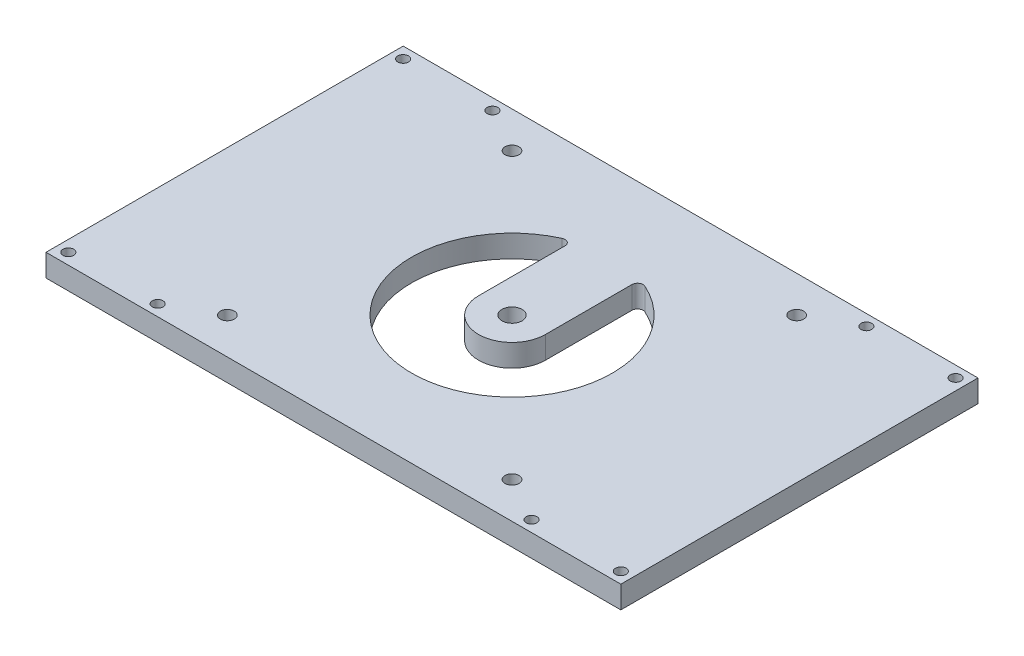
ISO-10303-21;
HEADER;
FILE_DESCRIPTION(('STEP AP214'),'2;1');
FILE_NAME('part.step','',(''),(''),'','','');
FILE_SCHEMA(('AUTOMOTIVE_DESIGN { 1 0 10303 214 1 1 1 1 }'));
ENDSEC;
DATA;
#1=APPLICATION_CONTEXT('core data for automotive mechanical design processes');
#2=APPLICATION_PROTOCOL_DEFINITION('international standard','automotive_design',2000,#1);
#3=PRODUCT_CONTEXT('',#1,'mechanical');
#4=PRODUCT('Part','Part','',(#3));
#5=PRODUCT_RELATED_PRODUCT_CATEGORY('part','',(#4));
#6=PRODUCT_DEFINITION_FORMATION('','',#4);
#7=PRODUCT_DEFINITION_CONTEXT('part definition',#1,'design');
#8=PRODUCT_DEFINITION('design','',#6,#7);
#9=PRODUCT_DEFINITION_SHAPE('','',#8);
#10=(LENGTH_UNIT() NAMED_UNIT(*) SI_UNIT(.MILLI.,.METRE.));
#11=(NAMED_UNIT(*) PLANE_ANGLE_UNIT() SI_UNIT($,.RADIAN.));
#12=(NAMED_UNIT(*) SI_UNIT($,.STERADIAN.) SOLID_ANGLE_UNIT());
#13=UNCERTAINTY_MEASURE_WITH_UNIT(LENGTH_MEASURE(1.E-05),#10,'distance_accuracy_value','');
#14=(GEOMETRIC_REPRESENTATION_CONTEXT(3) GLOBAL_UNCERTAINTY_ASSIGNED_CONTEXT((#13)) GLOBAL_UNIT_ASSIGNED_CONTEXT((#10,
#11,#12)) REPRESENTATION_CONTEXT('',''));
#15=CARTESIAN_POINT('',(0.,0.,0.));
#16=DIRECTION('',(0.,0.,1.));
#17=DIRECTION('',(1.,0.,0.));
#18=AXIS2_PLACEMENT_3D('',#15,#16,#17);
#19=CARTESIAN_POINT('',(-33.6068002357864,6.35,-20.9249888260557));
#20=DIRECTION('',(1.,0.,0.));
#21=DIRECTION('',(0.,0.,-1.));
#22=AXIS2_PLACEMENT_3D('',#19,#20,#21);
#23=PLANE('',#22);
#24=DIRECTION('',(0.,0.,1.));
#25=VECTOR('',#24,1.);
#26=CARTESIAN_POINT('',(-33.6068002357864,0.,-20.9249888260557));
#27=LINE('',#26,#25);
#28=CARTESIAN_POINT('',(-33.6068002357864,0.,-20.9249888260557));
#29=VERTEX_POINT('',#28);
#30=CARTESIAN_POINT('',(-33.6068002357864,0.,80.6750111739443));
#31=VERTEX_POINT('',#30);
#32=EDGE_CURVE('E234',#29,#31,#27,.T.);
#33=ORIENTED_EDGE('',*,*,#32,.T.);
#34=DIRECTION('',(0.,-1.,0.));
#35=VECTOR('',#34,1.);
#36=CARTESIAN_POINT('',(-33.6068002357864,6.35,80.6750111739443));
#37=LINE('',#36,#35);
#38=CARTESIAN_POINT('',(-33.6068002357864,6.35,80.6750111739443));
#39=VERTEX_POINT('',#38);
#40=EDGE_CURVE('E11',#39,#31,#37,.T.);
#41=ORIENTED_EDGE('',*,*,#40,.F.);
#42=DIRECTION('',(0.,0.,1.));
#43=VECTOR('',#42,1.);
#44=CARTESIAN_POINT('',(-33.6068002357864,6.35,-20.9249888260557));
#45=LINE('',#44,#43);
#46=CARTESIAN_POINT('',(-33.6068002357864,6.35,-20.9249888260557));
#47=VERTEX_POINT('',#46);
#48=EDGE_CURVE('E237',#47,#39,#45,.T.);
#49=ORIENTED_EDGE('',*,*,#48,.F.);
#50=DIRECTION('',(0.,-1.,0.));
#51=VECTOR('',#50,1.);
#52=CARTESIAN_POINT('',(-33.6068002357864,6.35,-20.9249888260557));
#53=LINE('',#52,#51);
#54=EDGE_CURVE('E247',#47,#29,#53,.T.);
#55=ORIENTED_EDGE('',*,*,#54,.T.);
#56=EDGE_LOOP('',(#33,#41,#49,#55));
#57=FACE_BOUND('',#56,.T.);
#58=ADVANCED_FACE('F31',(#57),#23,.F.);
#59=CARTESIAN_POINT('',(-33.6068002357864,6.35,80.6750111739443));
#60=DIRECTION('',(0.,0.,-1.));
#61=DIRECTION('',(-1.,0.,0.));
#62=AXIS2_PLACEMENT_3D('',#59,#60,#61);
#63=PLANE('',#62);
#64=DIRECTION('',(1.,0.,0.));
#65=VECTOR('',#64,1.);
#66=CARTESIAN_POINT('',(-33.6068002357864,0.,80.6750111739443));
#67=LINE('',#66,#65);
#68=CARTESIAN_POINT('',(129.905699764214,0.,80.6750111739443));
#69=VERTEX_POINT('',#68);
#70=EDGE_CURVE('E250',#31,#69,#67,.T.);
#71=ORIENTED_EDGE('',*,*,#70,.T.);
#72=DIRECTION('',(0.,-1.,0.));
#73=VECTOR('',#72,1.);
#74=CARTESIAN_POINT('',(129.905699764214,6.35,80.6750111739443));
#75=LINE('',#74,#73);
#76=CARTESIAN_POINT('',(129.905699764214,6.35,80.6750111739443));
#77=VERTEX_POINT('',#76);
#78=EDGE_CURVE('E38',#77,#69,#75,.T.);
#79=ORIENTED_EDGE('',*,*,#78,.F.);
#80=DIRECTION('',(1.,0.,0.));
#81=VECTOR('',#80,1.);
#82=CARTESIAN_POINT('',(-33.6068002357864,6.35,80.6750111739443));
#83=LINE('',#82,#81);
#84=EDGE_CURVE('E240',#39,#77,#83,.T.);
#85=ORIENTED_EDGE('',*,*,#84,.F.);
#86=ORIENTED_EDGE('',*,*,#40,.T.);
#87=EDGE_LOOP('',(#71,#79,#85,#86));
#88=FACE_BOUND('',#87,.T.);
#89=ADVANCED_FACE('F279',(#88),#63,.F.);
#90=CARTESIAN_POINT('',(129.905699764214,6.35,-20.9249888260557));
#91=DIRECTION('',(-1.,0.,0.));
#92=DIRECTION('',(0.,0.,1.));
#93=AXIS2_PLACEMENT_3D('',#90,#91,#92);
#94=PLANE('',#93);
#95=DIRECTION('',(0.,0.,-1.));
#96=VECTOR('',#95,1.);
#97=CARTESIAN_POINT('',(129.905699764214,0.,-20.9249888260557));
#98=LINE('',#97,#96);
#99=CARTESIAN_POINT('',(129.905699764214,0.,-20.9249888260557));
#100=VERTEX_POINT('',#99);
#101=EDGE_CURVE('E252',#69,#100,#98,.T.);
#102=ORIENTED_EDGE('',*,*,#101,.T.);
#103=DIRECTION('',(0.,-1.,0.));
#104=VECTOR('',#103,1.);
#105=CARTESIAN_POINT('',(129.905699764214,6.35,-20.9249888260557));
#106=LINE('',#105,#104);
#107=CARTESIAN_POINT('',(129.905699764214,6.35,-20.9249888260557));
#108=VERTEX_POINT('',#107);
#109=EDGE_CURVE('E257',#108,#100,#106,.T.);
#110=ORIENTED_EDGE('',*,*,#109,.F.);
#111=DIRECTION('',(0.,0.,-1.));
#112=VECTOR('',#111,1.);
#113=CARTESIAN_POINT('',(129.905699764214,6.35,-20.9249888260557));
#114=LINE('',#113,#112);
#115=EDGE_CURVE('E243',#77,#108,#114,.T.);
#116=ORIENTED_EDGE('',*,*,#115,.F.);
#117=ORIENTED_EDGE('',*,*,#78,.T.);
#118=EDGE_LOOP('',(#102,#110,#116,#117));
#119=FACE_BOUND('',#118,.T.);
#120=ADVANCED_FACE('F264',(#119),#94,.F.);
#121=CARTESIAN_POINT('',(-33.6068002357864,6.35,-20.9249888260557));
#122=DIRECTION('',(0.,0.,1.));
#123=DIRECTION('',(1.,0.,0.));
#124=AXIS2_PLACEMENT_3D('',#121,#122,#123);
#125=PLANE('',#124);
#126=DIRECTION('',(-1.,0.,0.));
#127=VECTOR('',#126,1.);
#128=CARTESIAN_POINT('',(-33.6068002357864,0.,-20.9249888260557));
#129=LINE('',#128,#127);
#130=EDGE_CURVE('E241',#100,#29,#129,.T.);
#131=ORIENTED_EDGE('',*,*,#130,.T.);
#132=ORIENTED_EDGE('',*,*,#54,.F.);
#133=DIRECTION('',(-1.,0.,0.));
#134=VECTOR('',#133,1.);
#135=CARTESIAN_POINT('',(-33.6068002357864,6.35,-20.9249888260557));
#136=LINE('',#135,#134);
#137=EDGE_CURVE('E245',#108,#47,#136,.T.);
#138=ORIENTED_EDGE('',*,*,#137,.F.);
#139=ORIENTED_EDGE('',*,*,#109,.T.);
#140=EDGE_LOOP('',(#131,#132,#138,#139));
#141=FACE_BOUND('',#140,.T.);
#142=ADVANCED_FACE('F273',(#141),#125,.F.);
#143=CARTESIAN_POINT('',(-33.6068002357864,6.35,-20.9249888260557));
#144=DIRECTION('',(0.,1.,0.));
#145=DIRECTION('',(0.,0.,1.));
#146=AXIS2_PLACEMENT_3D('',#143,#144,#145);
#147=PLANE('',#146);
#148=DIRECTION('',(0.,0.,-1.));
#149=VECTOR('',#148,1.);
#150=CARTESIAN_POINT('',(57.6744497642136,6.35,-120.001620076397));
#151=LINE('',#150,#149);
#152=CARTESIAN_POINT('',(57.6744497642136,6.35,29.8750111739443));
#153=VERTEX_POINT('',#152);
#154=CARTESIAN_POINT('',(57.6744497642136,6.35,5.28156692552723));
#155=VERTEX_POINT('',#154);
#156=EDGE_CURVE('E109',#153,#155,#151,.T.);
#157=ORIENTED_EDGE('',*,*,#156,.T.);
#158=CARTESIAN_POINT('',(59.2619497642136,6.35,5.28156692552721));
#159=DIRECTION('',(0.,-1.,0.));
#160=DIRECTION('',(0.,0.,-1.));
#161=AXIS2_PLACEMENT_3D('',#158,#159,#160);
#162=CIRCLE('',#161,1.5875);
#163=CARTESIAN_POINT('',(59.9156262348018,6.35,3.83489373444386));
#164=VERTEX_POINT('',#163);
#165=EDGE_CURVE('E118',#155,#164,#162,.T.);
#166=ORIENTED_EDGE('',*,*,#165,.T.);
#167=CARTESIAN_POINT('',(48.1494497642136,6.35,29.8750111739443));
#168=DIRECTION('',(0.,-1.,0.));
#169=DIRECTION('',(0.,0.,-1.));
#170=AXIS2_PLACEMENT_3D('',#167,#168,#169);
#171=CIRCLE('',#170,28.575);
#172=CARTESIAN_POINT('',(36.3832732936254,6.35,3.83489373444384));
#173=VERTEX_POINT('',#172);
#174=EDGE_CURVE('E45',#164,#173,#171,.T.);
#175=ORIENTED_EDGE('',*,*,#174,.T.);
#176=CARTESIAN_POINT('',(37.0369497642136,6.35,5.28156692552721));
#177=DIRECTION('',(0.,-1.,0.));
#178=DIRECTION('',(0.,0.,-1.));
#179=AXIS2_PLACEMENT_3D('',#176,#177,#178);
#180=CIRCLE('',#179,1.5875);
#181=CARTESIAN_POINT('',(38.6244497642136,6.35,5.2815669255272));
#182=VERTEX_POINT('',#181);
#183=EDGE_CURVE('E132',#173,#182,#180,.T.);
#184=ORIENTED_EDGE('',*,*,#183,.T.);
#185=DIRECTION('',(0.,0.,-1.));
#186=VECTOR('',#185,1.);
#187=CARTESIAN_POINT('',(38.6244497642136,6.35,-120.001620076397));
#188=LINE('',#187,#186);
#189=CARTESIAN_POINT('',(38.6244497642136,6.35,29.8750111739443));
#190=VERTEX_POINT('',#189);
#191=EDGE_CURVE('E135',#190,#182,#188,.T.);
#192=ORIENTED_EDGE('',*,*,#191,.F.);
#193=CARTESIAN_POINT('',(48.1494497642136,6.35,29.8750111739443));
#194=DIRECTION('',(0.,-1.,0.));
#195=DIRECTION('',(0.,0.,-1.));
#196=AXIS2_PLACEMENT_3D('',#193,#194,#195);
#197=CIRCLE('',#196,9.525);
#198=EDGE_CURVE('E115',#153,#190,#197,.T.);
#199=ORIENTED_EDGE('',*,*,#198,.F.);
#200=EDGE_LOOP('',(#157,#166,#175,#184,#192,#199));
#201=FACE_BOUND('',#200,.T.);
#202=CARTESIAN_POINT('',(48.1494497642136,6.35,29.8750111739443));
#203=DIRECTION('',(0.,1.,0.));
#204=DIRECTION('',(0.,0.,1.));
#205=AXIS2_PLACEMENT_3D('',#202,#203,#204);
#206=CIRCLE('',#205,2.850007);
#207=CARTESIAN_POINT('',(48.1494497642136,6.35,32.7250181739443));
#208=VERTEX_POINT('',#207);
#209=EDGE_CURVE('E151',#208,#208,#206,.T.);
#210=ORIENTED_EDGE('',*,*,#209,.F.);
#211=EDGE_LOOP('',(#210));
#212=FACE_BOUND('',#211,.T.);
#213=CARTESIAN_POINT('',(7.66184976421357,6.35,70.3626111739443));
#214=DIRECTION('',(0.,1.,0.));
#215=DIRECTION('',(0.,0.,1.));
#216=AXIS2_PLACEMENT_3D('',#213,#214,#215);
#217=CIRCLE('',#216,1.984375);
#218=CARTESIAN_POINT('',(7.66184976421357,6.35,72.3469861739443));
#219=VERTEX_POINT('',#218);
#220=EDGE_CURVE('E162',#219,#219,#217,.T.);
#221=ORIENTED_EDGE('',*,*,#220,.F.);
#222=EDGE_LOOP('',(#221));
#223=FACE_BOUND('',#222,.T.);
#224=CARTESIAN_POINT('',(88.6370497642136,6.35,70.3626111739443));
#225=DIRECTION('',(0.,1.,0.));
#226=DIRECTION('',(0.,0.,1.));
#227=AXIS2_PLACEMENT_3D('',#224,#225,#226);
#228=CIRCLE('',#227,1.98437499999999);
#229=CARTESIAN_POINT('',(88.6370497642136,6.35,72.3469861739443));
#230=VERTEX_POINT('',#229);
#231=EDGE_CURVE('E168',#230,#230,#228,.T.);
#232=ORIENTED_EDGE('',*,*,#231,.F.);
#233=EDGE_LOOP('',(#232));
#234=FACE_BOUND('',#233,.T.);
#235=CARTESIAN_POINT('',(88.6370497642136,6.35,-10.6125888260557));
#236=DIRECTION('',(0.,1.,0.));
#237=DIRECTION('',(0.,0.,1.));
#238=AXIS2_PLACEMENT_3D('',#235,#236,#237);
#239=CIRCLE('',#238,1.984375);
#240=CARTESIAN_POINT('',(88.6370497642136,6.35,-8.62821382605569));
#241=VERTEX_POINT('',#240);
#242=EDGE_CURVE('E174',#241,#241,#239,.T.);
#243=ORIENTED_EDGE('',*,*,#242,.F.);
#244=EDGE_LOOP('',(#243));
#245=FACE_BOUND('',#244,.T.);
#246=CARTESIAN_POINT('',(7.66184976421357,6.35,-10.6125888260557));
#247=DIRECTION('',(0.,1.,0.));
#248=DIRECTION('',(0.,0.,1.));
#249=AXIS2_PLACEMENT_3D('',#246,#247,#248);
#250=CIRCLE('',#249,1.984375);
#251=CARTESIAN_POINT('',(7.66184976421357,6.35,-8.62821382605569));
#252=VERTEX_POINT('',#251);
#253=EDGE_CURVE('E180',#252,#252,#250,.T.);
#254=ORIENTED_EDGE('',*,*,#253,.F.);
#255=EDGE_LOOP('',(#254));
#256=FACE_BOUND('',#255,.T.);
#257=CARTESIAN_POINT('',(101.330699764214,6.35,77.5000111739443));
#258=DIRECTION('',(0.,1.,0.));
#259=DIRECTION('',(0.,0.,1.));
#260=AXIS2_PLACEMENT_3D('',#257,#258,#259);
#261=CIRCLE('',#260,1.52399999999999);
#262=CARTESIAN_POINT('',(101.330699764214,6.35,79.0240111739443));
#263=VERTEX_POINT('',#262);
#264=EDGE_CURVE('E186',#263,#263,#261,.T.);
#265=ORIENTED_EDGE('',*,*,#264,.F.);
#266=EDGE_LOOP('',(#265));
#267=FACE_BOUND('',#266,.T.);
#268=CARTESIAN_POINT('',(101.330699764214,6.35,-17.7499888260557));
#269=DIRECTION('',(0.,1.,0.));
#270=DIRECTION('',(0.,0.,1.));
#271=AXIS2_PLACEMENT_3D('',#268,#269,#270);
#272=CIRCLE('',#271,1.52399999999999);
#273=CARTESIAN_POINT('',(101.330699764214,6.35,-16.2259888260557));
#274=VERTEX_POINT('',#273);
#275=EDGE_CURVE('E192',#274,#274,#272,.T.);
#276=ORIENTED_EDGE('',*,*,#275,.F.);
#277=EDGE_LOOP('',(#276));
#278=FACE_BOUND('',#277,.T.);
#279=CARTESIAN_POINT('',(-5.03180023578643,6.35,77.5000111739443));
#280=DIRECTION('',(0.,1.,0.));
#281=DIRECTION('',(0.,0.,1.));
#282=AXIS2_PLACEMENT_3D('',#279,#280,#281);
#283=CIRCLE('',#282,1.524);
#284=CARTESIAN_POINT('',(-5.03180023578643,6.35,79.0240111739443));
#285=VERTEX_POINT('',#284);
#286=EDGE_CURVE('E198',#285,#285,#283,.T.);
#287=ORIENTED_EDGE('',*,*,#286,.F.);
#288=EDGE_LOOP('',(#287));
#289=FACE_BOUND('',#288,.T.);
#290=CARTESIAN_POINT('',(-5.03180023578643,6.35,-17.7499888260557));
#291=DIRECTION('',(0.,1.,0.));
#292=DIRECTION('',(0.,0.,1.));
#293=AXIS2_PLACEMENT_3D('',#290,#291,#292);
#294=CIRCLE('',#293,1.524);
#295=CARTESIAN_POINT('',(-5.03180023578643,6.35,-16.2259888260557));
#296=VERTEX_POINT('',#295);
#297=EDGE_CURVE('E204',#296,#296,#294,.T.);
#298=ORIENTED_EDGE('',*,*,#297,.F.);
#299=EDGE_LOOP('',(#298));
#300=FACE_BOUND('',#299,.T.);
#301=CARTESIAN_POINT('',(126.730699764214,6.35,-17.7499888260557));
#302=DIRECTION('',(0.,1.,0.));
#303=DIRECTION('',(0.,0.,1.));
#304=AXIS2_PLACEMENT_3D('',#301,#302,#303);
#305=CIRCLE('',#304,1.52400000000001);
#306=CARTESIAN_POINT('',(126.730699764214,6.35,-16.2259888260557));
#307=VERTEX_POINT('',#306);
#308=EDGE_CURVE('E210',#307,#307,#305,.T.);
#309=ORIENTED_EDGE('',*,*,#308,.F.);
#310=EDGE_LOOP('',(#309));
#311=FACE_BOUND('',#310,.T.);
#312=CARTESIAN_POINT('',(126.730699764214,6.35,77.5000111739443));
#313=DIRECTION('',(0.,1.,0.));
#314=DIRECTION('',(0.,0.,1.));
#315=AXIS2_PLACEMENT_3D('',#312,#313,#314);
#316=CIRCLE('',#315,1.52400000000001);
#317=CARTESIAN_POINT('',(126.730699764214,6.35,79.0240111739443));
#318=VERTEX_POINT('',#317);
#319=EDGE_CURVE('E216',#318,#318,#316,.T.);
#320=ORIENTED_EDGE('',*,*,#319,.F.);
#321=EDGE_LOOP('',(#320));
#322=FACE_BOUND('',#321,.T.);
#323=CARTESIAN_POINT('',(-30.4318002357864,6.35,77.5000111739443));
#324=DIRECTION('',(0.,1.,0.));
#325=DIRECTION('',(0.,0.,1.));
#326=AXIS2_PLACEMENT_3D('',#323,#324,#325);
#327=CIRCLE('',#326,1.524);
#328=CARTESIAN_POINT('',(-30.4318002357864,6.35,79.0240111739443));
#329=VERTEX_POINT('',#328);
#330=EDGE_CURVE('E222',#329,#329,#327,.T.);
#331=ORIENTED_EDGE('',*,*,#330,.F.);
#332=EDGE_LOOP('',(#331));
#333=FACE_BOUND('',#332,.T.);
#334=CARTESIAN_POINT('',(-30.4318002357864,6.35,-17.7499888260557));
#335=DIRECTION('',(0.,1.,0.));
#336=DIRECTION('',(0.,0.,1.));
#337=AXIS2_PLACEMENT_3D('',#334,#335,#336);
#338=CIRCLE('',#337,1.524);
#339=CARTESIAN_POINT('',(-30.4318002357864,6.35,-16.2259888260557));
#340=VERTEX_POINT('',#339);
#341=EDGE_CURVE('E228',#340,#340,#338,.T.);
#342=ORIENTED_EDGE('',*,*,#341,.F.);
#343=EDGE_LOOP('',(#342));
#344=FACE_BOUND('',#343,.T.);
#345=ORIENTED_EDGE('',*,*,#48,.T.);
#346=ORIENTED_EDGE('',*,*,#84,.T.);
#347=ORIENTED_EDGE('',*,*,#115,.T.);
#348=ORIENTED_EDGE('',*,*,#137,.T.);
#349=EDGE_LOOP('',(#345,#346,#347,#348));
#350=FACE_BOUND('',#349,.T.);
#351=ADVANCED_FACE('F122',(#201,#212,#223,#234,#245,#256,#267,#278,#289,#300,#311,#322,#333,
#344,#350),#147,.T.);
#352=CARTESIAN_POINT('',(-33.6068002357864,0.,-20.9249888260557));
#353=DIRECTION('',(0.,1.,0.));
#354=DIRECTION('',(0.,0.,1.));
#355=AXIS2_PLACEMENT_3D('',#352,#353,#354);
#356=PLANE('',#355);
#357=CARTESIAN_POINT('',(59.2619497642136,0.,5.28156692552721));
#358=DIRECTION('',(0.,-1.,0.));
#359=DIRECTION('',(0.,0.,-1.));
#360=AXIS2_PLACEMENT_3D('',#357,#358,#359);
#361=CIRCLE('',#360,1.5875);
#362=CARTESIAN_POINT('',(57.6744497642136,0.,5.28156692552723));
#363=VERTEX_POINT('',#362);
#364=CARTESIAN_POINT('',(59.9156262348018,0.,3.83489373444384));
#365=VERTEX_POINT('',#364);
#366=EDGE_CURVE('E139',#363,#365,#361,.T.);
#367=ORIENTED_EDGE('',*,*,#366,.F.);
#368=DIRECTION('',(0.,0.,-1.));
#369=VECTOR('',#368,1.);
#370=CARTESIAN_POINT('',(57.6744497642136,0.,-120.001620076397));
#371=LINE('',#370,#369);
#372=CARTESIAN_POINT('',(57.6744497642136,0.,29.8750111739443));
#373=VERTEX_POINT('',#372);
#374=EDGE_CURVE('E53',#373,#363,#371,.T.);
#375=ORIENTED_EDGE('',*,*,#374,.F.);
#376=CARTESIAN_POINT('',(48.1494497642136,0.,29.8750111739443));
#377=DIRECTION('',(0.,-1.,0.));
#378=DIRECTION('',(0.,0.,-1.));
#379=AXIS2_PLACEMENT_3D('',#376,#377,#378);
#380=CIRCLE('',#379,9.525);
#381=CARTESIAN_POINT('',(38.6244497642136,0.,29.8750111739443));
#382=VERTEX_POINT('',#381);
#383=EDGE_CURVE('E125',#373,#382,#380,.T.);
#384=ORIENTED_EDGE('',*,*,#383,.T.);
#385=DIRECTION('',(0.,0.,-1.));
#386=VECTOR('',#385,1.);
#387=CARTESIAN_POINT('',(38.6244497642136,0.,-120.001620076397));
#388=LINE('',#387,#386);
#389=CARTESIAN_POINT('',(38.6244497642136,0.,5.2815669255272));
#390=VERTEX_POINT('',#389);
#391=EDGE_CURVE('E128',#382,#390,#388,.T.);
#392=ORIENTED_EDGE('',*,*,#391,.T.);
#393=CARTESIAN_POINT('',(37.0369497642136,0.,5.28156692552721));
#394=DIRECTION('',(0.,-1.,0.));
#395=DIRECTION('',(0.,0.,-1.));
#396=AXIS2_PLACEMENT_3D('',#393,#394,#395);
#397=CIRCLE('',#396,1.5875);
#398=CARTESIAN_POINT('',(36.3832732936254,0.,3.83489373444384));
#399=VERTEX_POINT('',#398);
#400=EDGE_CURVE('E144',#399,#390,#397,.T.);
#401=ORIENTED_EDGE('',*,*,#400,.F.);
#402=CARTESIAN_POINT('',(48.1494497642136,0.,29.8750111739443));
#403=DIRECTION('',(0.,-1.,0.));
#404=DIRECTION('',(0.,0.,-1.));
#405=AXIS2_PLACEMENT_3D('',#402,#403,#404);
#406=CIRCLE('',#405,28.575);
#407=EDGE_CURVE('E141',#365,#399,#406,.T.);
#408=ORIENTED_EDGE('',*,*,#407,.F.);
#409=EDGE_LOOP('',(#367,#375,#384,#392,#401,#408));
#410=FACE_BOUND('',#409,.T.);
#411=CARTESIAN_POINT('',(48.1494497642136,0.,29.8750111739443));
#412=DIRECTION('',(0.,1.,0.));
#413=DIRECTION('',(0.,0.,1.));
#414=AXIS2_PLACEMENT_3D('',#411,#412,#413);
#415=CIRCLE('',#414,2.850007);
#416=CARTESIAN_POINT('',(48.1494497642136,0.,32.7250181739443));
#417=VERTEX_POINT('',#416);
#418=EDGE_CURVE('E159',#417,#417,#415,.T.);
#419=ORIENTED_EDGE('',*,*,#418,.T.);
#420=EDGE_LOOP('',(#419));
#421=FACE_BOUND('',#420,.T.);
#422=CARTESIAN_POINT('',(7.66184976421357,0.,70.3626111739443));
#423=DIRECTION('',(0.,1.,0.));
#424=DIRECTION('',(0.,0.,1.));
#425=AXIS2_PLACEMENT_3D('',#422,#423,#424);
#426=CIRCLE('',#425,1.984375);
#427=CARTESIAN_POINT('',(7.66184976421357,0.,72.3469861739443));
#428=VERTEX_POINT('',#427);
#429=EDGE_CURVE('E165',#428,#428,#426,.T.);
#430=ORIENTED_EDGE('',*,*,#429,.T.);
#431=EDGE_LOOP('',(#430));
#432=FACE_BOUND('',#431,.T.);
#433=CARTESIAN_POINT('',(88.6370497642136,0.,70.3626111739443));
#434=DIRECTION('',(0.,1.,0.));
#435=DIRECTION('',(0.,0.,1.));
#436=AXIS2_PLACEMENT_3D('',#433,#434,#435);
#437=CIRCLE('',#436,1.98437499999999);
#438=CARTESIAN_POINT('',(88.6370497642136,0.,72.3469861739443));
#439=VERTEX_POINT('',#438);
#440=EDGE_CURVE('E171',#439,#439,#437,.T.);
#441=ORIENTED_EDGE('',*,*,#440,.T.);
#442=EDGE_LOOP('',(#441));
#443=FACE_BOUND('',#442,.T.);
#444=CARTESIAN_POINT('',(88.6370497642136,0.,-10.6125888260557));
#445=DIRECTION('',(0.,1.,0.));
#446=DIRECTION('',(0.,0.,1.));
#447=AXIS2_PLACEMENT_3D('',#444,#445,#446);
#448=CIRCLE('',#447,1.984375);
#449=CARTESIAN_POINT('',(88.6370497642136,0.,-8.62821382605569));
#450=VERTEX_POINT('',#449);
#451=EDGE_CURVE('E177',#450,#450,#448,.T.);
#452=ORIENTED_EDGE('',*,*,#451,.T.);
#453=EDGE_LOOP('',(#452));
#454=FACE_BOUND('',#453,.T.);
#455=CARTESIAN_POINT('',(7.66184976421357,0.,-10.6125888260557));
#456=DIRECTION('',(0.,1.,0.));
#457=DIRECTION('',(0.,0.,1.));
#458=AXIS2_PLACEMENT_3D('',#455,#456,#457);
#459=CIRCLE('',#458,1.984375);
#460=CARTESIAN_POINT('',(7.66184976421357,0.,-8.62821382605569));
#461=VERTEX_POINT('',#460);
#462=EDGE_CURVE('E183',#461,#461,#459,.T.);
#463=ORIENTED_EDGE('',*,*,#462,.T.);
#464=EDGE_LOOP('',(#463));
#465=FACE_BOUND('',#464,.T.);
#466=CARTESIAN_POINT('',(101.330699764214,0.,77.5000111739443));
#467=DIRECTION('',(0.,1.,0.));
#468=DIRECTION('',(0.,0.,1.));
#469=AXIS2_PLACEMENT_3D('',#466,#467,#468);
#470=CIRCLE('',#469,1.52399999999999);
#471=CARTESIAN_POINT('',(101.330699764214,0.,79.0240111739443));
#472=VERTEX_POINT('',#471);
#473=EDGE_CURVE('E189',#472,#472,#470,.T.);
#474=ORIENTED_EDGE('',*,*,#473,.T.);
#475=EDGE_LOOP('',(#474));
#476=FACE_BOUND('',#475,.T.);
#477=CARTESIAN_POINT('',(101.330699764214,0.,-17.7499888260557));
#478=DIRECTION('',(0.,1.,0.));
#479=DIRECTION('',(0.,0.,1.));
#480=AXIS2_PLACEMENT_3D('',#477,#478,#479);
#481=CIRCLE('',#480,1.52399999999999);
#482=CARTESIAN_POINT('',(101.330699764214,0.,-16.2259888260557));
#483=VERTEX_POINT('',#482);
#484=EDGE_CURVE('E195',#483,#483,#481,.T.);
#485=ORIENTED_EDGE('',*,*,#484,.T.);
#486=EDGE_LOOP('',(#485));
#487=FACE_BOUND('',#486,.T.);
#488=CARTESIAN_POINT('',(-5.03180023578643,0.,77.5000111739443));
#489=DIRECTION('',(0.,1.,0.));
#490=DIRECTION('',(0.,0.,1.));
#491=AXIS2_PLACEMENT_3D('',#488,#489,#490);
#492=CIRCLE('',#491,1.524);
#493=CARTESIAN_POINT('',(-5.03180023578643,0.,79.0240111739443));
#494=VERTEX_POINT('',#493);
#495=EDGE_CURVE('E201',#494,#494,#492,.T.);
#496=ORIENTED_EDGE('',*,*,#495,.T.);
#497=EDGE_LOOP('',(#496));
#498=FACE_BOUND('',#497,.T.);
#499=CARTESIAN_POINT('',(-5.03180023578643,0.,-17.7499888260557));
#500=DIRECTION('',(0.,1.,0.));
#501=DIRECTION('',(0.,0.,1.));
#502=AXIS2_PLACEMENT_3D('',#499,#500,#501);
#503=CIRCLE('',#502,1.524);
#504=CARTESIAN_POINT('',(-5.03180023578643,0.,-16.2259888260557));
#505=VERTEX_POINT('',#504);
#506=EDGE_CURVE('E207',#505,#505,#503,.T.);
#507=ORIENTED_EDGE('',*,*,#506,.T.);
#508=EDGE_LOOP('',(#507));
#509=FACE_BOUND('',#508,.T.);
#510=CARTESIAN_POINT('',(126.730699764214,0.,-17.7499888260557));
#511=DIRECTION('',(0.,1.,0.));
#512=DIRECTION('',(0.,0.,1.));
#513=AXIS2_PLACEMENT_3D('',#510,#511,#512);
#514=CIRCLE('',#513,1.52400000000001);
#515=CARTESIAN_POINT('',(126.730699764214,0.,-16.2259888260557));
#516=VERTEX_POINT('',#515);
#517=EDGE_CURVE('E213',#516,#516,#514,.T.);
#518=ORIENTED_EDGE('',*,*,#517,.T.);
#519=EDGE_LOOP('',(#518));
#520=FACE_BOUND('',#519,.T.);
#521=CARTESIAN_POINT('',(126.730699764214,0.,77.5000111739443));
#522=DIRECTION('',(0.,1.,0.));
#523=DIRECTION('',(0.,0.,1.));
#524=AXIS2_PLACEMENT_3D('',#521,#522,#523);
#525=CIRCLE('',#524,1.52400000000001);
#526=CARTESIAN_POINT('',(126.730699764214,0.,79.0240111739443));
#527=VERTEX_POINT('',#526);
#528=EDGE_CURVE('E219',#527,#527,#525,.T.);
#529=ORIENTED_EDGE('',*,*,#528,.T.);
#530=EDGE_LOOP('',(#529));
#531=FACE_BOUND('',#530,.T.);
#532=CARTESIAN_POINT('',(-30.4318002357864,0.,77.5000111739443));
#533=DIRECTION('',(0.,1.,0.));
#534=DIRECTION('',(0.,0.,1.));
#535=AXIS2_PLACEMENT_3D('',#532,#533,#534);
#536=CIRCLE('',#535,1.524);
#537=CARTESIAN_POINT('',(-30.4318002357864,0.,79.0240111739443));
#538=VERTEX_POINT('',#537);
#539=EDGE_CURVE('E225',#538,#538,#536,.T.);
#540=ORIENTED_EDGE('',*,*,#539,.T.);
#541=EDGE_LOOP('',(#540));
#542=FACE_BOUND('',#541,.T.);
#543=CARTESIAN_POINT('',(-30.4318002357864,0.,-17.7499888260557));
#544=DIRECTION('',(0.,1.,0.));
#545=DIRECTION('',(0.,0.,1.));
#546=AXIS2_PLACEMENT_3D('',#543,#544,#545);
#547=CIRCLE('',#546,1.524);
#548=CARTESIAN_POINT('',(-30.4318002357864,0.,-16.2259888260557));
#549=VERTEX_POINT('',#548);
#550=EDGE_CURVE('E231',#549,#549,#547,.T.);
#551=ORIENTED_EDGE('',*,*,#550,.T.);
#552=EDGE_LOOP('',(#551));
#553=FACE_BOUND('',#552,.T.);
#554=ORIENTED_EDGE('',*,*,#32,.F.);
#555=ORIENTED_EDGE('',*,*,#130,.F.);
#556=ORIENTED_EDGE('',*,*,#101,.F.);
#557=ORIENTED_EDGE('',*,*,#70,.F.);
#558=EDGE_LOOP('',(#554,#555,#556,#557));
#559=FACE_BOUND('',#558,.T.);
#560=ADVANCED_FACE('F270',(#410,#421,#432,#443,#454,#465,#476,#487,#498,#509,#520,#531,#542,
#553,#559),#356,.F.);
#561=CARTESIAN_POINT('',(-30.4318002357864,0.,-17.7499888260557));
#562=DIRECTION('',(0.,1.,0.));
#563=DIRECTION('',(0.,0.,1.));
#564=AXIS2_PLACEMENT_3D('',#561,#562,#563);
#565=CYLINDRICAL_SURFACE('',#564,1.524);
#566=ORIENTED_EDGE('',*,*,#550,.F.);
#567=EDGE_LOOP('',(#566));
#568=FACE_BOUND('',#567,.T.);
#569=ORIENTED_EDGE('',*,*,#341,.T.);
#570=EDGE_LOOP('',(#569));
#571=FACE_BOUND('',#570,.T.);
#572=ADVANCED_FACE('F291',(#568,#571),#565,.F.);
#573=CARTESIAN_POINT('',(-30.4318002357864,0.,77.5000111739443));
#574=DIRECTION('',(0.,1.,0.));
#575=DIRECTION('',(0.,0.,1.));
#576=AXIS2_PLACEMENT_3D('',#573,#574,#575);
#577=CYLINDRICAL_SURFACE('',#576,1.524);
#578=ORIENTED_EDGE('',*,*,#539,.F.);
#579=EDGE_LOOP('',(#578));
#580=FACE_BOUND('',#579,.T.);
#581=ORIENTED_EDGE('',*,*,#330,.T.);
#582=EDGE_LOOP('',(#581));
#583=FACE_BOUND('',#582,.T.);
#584=ADVANCED_FACE('F297',(#580,#583),#577,.F.);
#585=CARTESIAN_POINT('',(126.730699764214,0.,77.5000111739443));
#586=DIRECTION('',(0.,1.,0.));
#587=DIRECTION('',(0.,0.,1.));
#588=AXIS2_PLACEMENT_3D('',#585,#586,#587);
#589=CYLINDRICAL_SURFACE('',#588,1.52400000000001);
#590=ORIENTED_EDGE('',*,*,#528,.F.);
#591=EDGE_LOOP('',(#590));
#592=FACE_BOUND('',#591,.T.);
#593=ORIENTED_EDGE('',*,*,#319,.T.);
#594=EDGE_LOOP('',(#593));
#595=FACE_BOUND('',#594,.T.);
#596=ADVANCED_FACE('F301',(#592,#595),#589,.F.);
#597=CARTESIAN_POINT('',(126.730699764214,0.,-17.7499888260557));
#598=DIRECTION('',(0.,1.,0.));
#599=DIRECTION('',(0.,0.,1.));
#600=AXIS2_PLACEMENT_3D('',#597,#598,#599);
#601=CYLINDRICAL_SURFACE('',#600,1.52400000000001);
#602=ORIENTED_EDGE('',*,*,#517,.F.);
#603=EDGE_LOOP('',(#602));
#604=FACE_BOUND('',#603,.T.);
#605=ORIENTED_EDGE('',*,*,#308,.T.);
#606=EDGE_LOOP('',(#605));
#607=FACE_BOUND('',#606,.T.);
#608=ADVANCED_FACE('F305',(#604,#607),#601,.F.);
#609=CARTESIAN_POINT('',(-5.03180023578643,0.,-17.7499888260557));
#610=DIRECTION('',(0.,1.,0.));
#611=DIRECTION('',(0.,0.,1.));
#612=AXIS2_PLACEMENT_3D('',#609,#610,#611);
#613=CYLINDRICAL_SURFACE('',#612,1.524);
#614=ORIENTED_EDGE('',*,*,#506,.F.);
#615=EDGE_LOOP('',(#614));
#616=FACE_BOUND('',#615,.T.);
#617=ORIENTED_EDGE('',*,*,#297,.T.);
#618=EDGE_LOOP('',(#617));
#619=FACE_BOUND('',#618,.T.);
#620=ADVANCED_FACE('F309',(#616,#619),#613,.F.);
#621=CARTESIAN_POINT('',(-5.03180023578643,0.,77.5000111739443));
#622=DIRECTION('',(0.,1.,0.));
#623=DIRECTION('',(0.,0.,1.));
#624=AXIS2_PLACEMENT_3D('',#621,#622,#623);
#625=CYLINDRICAL_SURFACE('',#624,1.524);
#626=ORIENTED_EDGE('',*,*,#495,.F.);
#627=EDGE_LOOP('',(#626));
#628=FACE_BOUND('',#627,.T.);
#629=ORIENTED_EDGE('',*,*,#286,.T.);
#630=EDGE_LOOP('',(#629));
#631=FACE_BOUND('',#630,.T.);
#632=ADVANCED_FACE('F313',(#628,#631),#625,.F.);
#633=CARTESIAN_POINT('',(101.330699764214,0.,-17.7499888260557));
#634=DIRECTION('',(0.,1.,0.));
#635=DIRECTION('',(0.,0.,1.));
#636=AXIS2_PLACEMENT_3D('',#633,#634,#635);
#637=CYLINDRICAL_SURFACE('',#636,1.52399999999999);
#638=ORIENTED_EDGE('',*,*,#484,.F.);
#639=EDGE_LOOP('',(#638));
#640=FACE_BOUND('',#639,.T.);
#641=ORIENTED_EDGE('',*,*,#275,.T.);
#642=EDGE_LOOP('',(#641));
#643=FACE_BOUND('',#642,.T.);
#644=ADVANCED_FACE('F317',(#640,#643),#637,.F.);
#645=CARTESIAN_POINT('',(101.330699764214,0.,77.5000111739443));
#646=DIRECTION('',(0.,1.,0.));
#647=DIRECTION('',(0.,0.,1.));
#648=AXIS2_PLACEMENT_3D('',#645,#646,#647);
#649=CYLINDRICAL_SURFACE('',#648,1.52399999999999);
#650=ORIENTED_EDGE('',*,*,#473,.F.);
#651=EDGE_LOOP('',(#650));
#652=FACE_BOUND('',#651,.T.);
#653=ORIENTED_EDGE('',*,*,#264,.T.);
#654=EDGE_LOOP('',(#653));
#655=FACE_BOUND('',#654,.T.);
#656=ADVANCED_FACE('F321',(#652,#655),#649,.F.);
#657=CARTESIAN_POINT('',(7.66184976421357,0.,-10.6125888260557));
#658=DIRECTION('',(0.,1.,0.));
#659=DIRECTION('',(0.,0.,1.));
#660=AXIS2_PLACEMENT_3D('',#657,#658,#659);
#661=CYLINDRICAL_SURFACE('',#660,1.984375);
#662=ORIENTED_EDGE('',*,*,#462,.F.);
#663=EDGE_LOOP('',(#662));
#664=FACE_BOUND('',#663,.T.);
#665=ORIENTED_EDGE('',*,*,#253,.T.);
#666=EDGE_LOOP('',(#665));
#667=FACE_BOUND('',#666,.T.);
#668=ADVANCED_FACE('F325',(#664,#667),#661,.F.);
#669=CARTESIAN_POINT('',(88.6370497642136,0.,-10.6125888260557));
#670=DIRECTION('',(0.,1.,0.));
#671=DIRECTION('',(0.,0.,1.));
#672=AXIS2_PLACEMENT_3D('',#669,#670,#671);
#673=CYLINDRICAL_SURFACE('',#672,1.984375);
#674=ORIENTED_EDGE('',*,*,#451,.F.);
#675=EDGE_LOOP('',(#674));
#676=FACE_BOUND('',#675,.T.);
#677=ORIENTED_EDGE('',*,*,#242,.T.);
#678=EDGE_LOOP('',(#677));
#679=FACE_BOUND('',#678,.T.);
#680=ADVANCED_FACE('F329',(#676,#679),#673,.F.);
#681=CARTESIAN_POINT('',(88.6370497642136,0.,70.3626111739443));
#682=DIRECTION('',(0.,1.,0.));
#683=DIRECTION('',(0.,0.,1.));
#684=AXIS2_PLACEMENT_3D('',#681,#682,#683);
#685=CYLINDRICAL_SURFACE('',#684,1.98437499999999);
#686=ORIENTED_EDGE('',*,*,#440,.F.);
#687=EDGE_LOOP('',(#686));
#688=FACE_BOUND('',#687,.T.);
#689=ORIENTED_EDGE('',*,*,#231,.T.);
#690=EDGE_LOOP('',(#689));
#691=FACE_BOUND('',#690,.T.);
#692=ADVANCED_FACE('F333',(#688,#691),#685,.F.);
#693=CARTESIAN_POINT('',(7.66184976421357,0.,70.3626111739443));
#694=DIRECTION('',(0.,1.,0.));
#695=DIRECTION('',(0.,0.,1.));
#696=AXIS2_PLACEMENT_3D('',#693,#694,#695);
#697=CYLINDRICAL_SURFACE('',#696,1.984375);
#698=ORIENTED_EDGE('',*,*,#429,.F.);
#699=EDGE_LOOP('',(#698));
#700=FACE_BOUND('',#699,.T.);
#701=ORIENTED_EDGE('',*,*,#220,.T.);
#702=EDGE_LOOP('',(#701));
#703=FACE_BOUND('',#702,.T.);
#704=ADVANCED_FACE('F337',(#700,#703),#697,.F.);
#705=CARTESIAN_POINT('',(48.1494497642136,0.,29.8750111739443));
#706=DIRECTION('',(0.,1.,0.));
#707=DIRECTION('',(0.,0.,1.));
#708=AXIS2_PLACEMENT_3D('',#705,#706,#707);
#709=CYLINDRICAL_SURFACE('',#708,2.850007);
#710=ORIENTED_EDGE('',*,*,#418,.F.);
#711=EDGE_LOOP('',(#710));
#712=FACE_BOUND('',#711,.T.);
#713=ORIENTED_EDGE('',*,*,#209,.T.);
#714=EDGE_LOOP('',(#713));
#715=FACE_BOUND('',#714,.T.);
#716=ADVANCED_FACE('F341',(#712,#715),#709,.F.);
#717=CARTESIAN_POINT('',(57.6744497642136,6.35,-120.001620076397));
#718=DIRECTION('',(-1.,0.,0.));
#719=DIRECTION('',(0.,0.,1.));
#720=AXIS2_PLACEMENT_3D('',#717,#718,#719);
#721=PLANE('',#720);
#722=ORIENTED_EDGE('',*,*,#374,.T.);
#723=DIRECTION('',(0.,-1.,0.));
#724=VECTOR('',#723,1.);
#725=CARTESIAN_POINT('',(57.6744497642136,6.35,5.28156692552723));
#726=LINE('',#725,#724);
#727=EDGE_CURVE('E105',#155,#363,#726,.T.);
#728=ORIENTED_EDGE('',*,*,#727,.F.);
#729=ORIENTED_EDGE('',*,*,#156,.F.);
#730=DIRECTION('',(0.,-1.,0.));
#731=VECTOR('',#730,1.);
#732=CARTESIAN_POINT('',(57.6744497642136,6.35,29.8750111739443));
#733=LINE('',#732,#731);
#734=EDGE_CURVE('E149',#153,#373,#733,.T.);
#735=ORIENTED_EDGE('',*,*,#734,.T.);
#736=EDGE_LOOP('',(#722,#728,#729,#735));
#737=FACE_BOUND('',#736,.T.);
#738=ADVANCED_FACE('F107',(#737),#721,.F.);
#739=CARTESIAN_POINT('',(48.1494497642136,6.35,29.8750111739443));
#740=DIRECTION('',(0.,-1.,0.));
#741=DIRECTION('',(0.,0.,-1.));
#742=AXIS2_PLACEMENT_3D('',#739,#740,#741);
#743=CYLINDRICAL_SURFACE('',#742,9.525);
#744=ORIENTED_EDGE('',*,*,#383,.F.);
#745=ORIENTED_EDGE('',*,*,#734,.F.);
#746=ORIENTED_EDGE('',*,*,#198,.T.);
#747=DIRECTION('',(0.,-1.,0.));
#748=VECTOR('',#747,1.);
#749=CARTESIAN_POINT('',(38.6244497642136,6.35,29.8750111739443));
#750=LINE('',#749,#748);
#751=EDGE_CURVE('E152',#190,#382,#750,.T.);
#752=ORIENTED_EDGE('',*,*,#751,.T.);
#753=EDGE_LOOP('',(#744,#745,#746,#752));
#754=FACE_BOUND('',#753,.T.);
#755=ADVANCED_FACE('F348',(#754),#743,.T.);
#756=CARTESIAN_POINT('',(38.6244497642136,6.35,-120.001620076397));
#757=DIRECTION('',(-1.,0.,0.));
#758=DIRECTION('',(0.,0.,1.));
#759=AXIS2_PLACEMENT_3D('',#756,#757,#758);
#760=PLANE('',#759);
#761=ORIENTED_EDGE('',*,*,#391,.F.);
#762=ORIENTED_EDGE('',*,*,#751,.F.);
#763=ORIENTED_EDGE('',*,*,#191,.T.);
#764=DIRECTION('',(0.,-1.,0.));
#765=VECTOR('',#764,1.);
#766=CARTESIAN_POINT('',(38.6244497642136,6.35,5.2815669255272));
#767=LINE('',#766,#765);
#768=EDGE_CURVE('E154',#182,#390,#767,.T.);
#769=ORIENTED_EDGE('',*,*,#768,.T.);
#770=EDGE_LOOP('',(#761,#762,#763,#769));
#771=FACE_BOUND('',#770,.T.);
#772=ADVANCED_FACE('F357',(#771),#760,.T.);
#773=CARTESIAN_POINT('',(37.0369497642136,6.35,5.28156692552721));
#774=DIRECTION('',(0.,-1.,0.));
#775=DIRECTION('',(0.,0.,-1.));
#776=AXIS2_PLACEMENT_3D('',#773,#774,#775);
#777=CYLINDRICAL_SURFACE('',#776,1.5875);
#778=ORIENTED_EDGE('',*,*,#400,.T.);
#779=ORIENTED_EDGE('',*,*,#768,.F.);
#780=ORIENTED_EDGE('',*,*,#183,.F.);
#781=DIRECTION('',(0.,-1.,0.));
#782=VECTOR('',#781,1.);
#783=CARTESIAN_POINT('',(36.3832732936254,6.35,3.83489373444384));
#784=LINE('',#783,#782);
#785=EDGE_CURVE('E156',#173,#399,#784,.T.);
#786=ORIENTED_EDGE('',*,*,#785,.T.);
#787=EDGE_LOOP('',(#778,#779,#780,#786));
#788=FACE_BOUND('',#787,.T.);
#789=ADVANCED_FACE('F354',(#788),#777,.F.);
#790=CARTESIAN_POINT('',(48.1494497642136,6.35,29.8750111739443));
#791=DIRECTION('',(0.,-1.,0.));
#792=DIRECTION('',(0.,0.,-1.));
#793=AXIS2_PLACEMENT_3D('',#790,#791,#792);
#794=CYLINDRICAL_SURFACE('',#793,28.575);
#795=ORIENTED_EDGE('',*,*,#407,.T.);
#796=ORIENTED_EDGE('',*,*,#785,.F.);
#797=ORIENTED_EDGE('',*,*,#174,.F.);
#798=DIRECTION('',(0.,-1.,0.));
#799=VECTOR('',#798,1.);
#800=CARTESIAN_POINT('',(59.9156262348018,6.35,3.83489373444384));
#801=LINE('',#800,#799);
#802=EDGE_CURVE('E114',#164,#365,#801,.T.);
#803=ORIENTED_EDGE('',*,*,#802,.T.);
#804=EDGE_LOOP('',(#795,#796,#797,#803));
#805=FACE_BOUND('',#804,.T.);
#806=ADVANCED_FACE('F351',(#805),#794,.F.);
#807=CARTESIAN_POINT('',(59.2619497642136,6.35,5.28156692552721));
#808=DIRECTION('',(0.,-1.,0.));
#809=DIRECTION('',(0.,0.,-1.));
#810=AXIS2_PLACEMENT_3D('',#807,#808,#809);
#811=CYLINDRICAL_SURFACE('',#810,1.5875);
#812=ORIENTED_EDGE('',*,*,#366,.T.);
#813=ORIENTED_EDGE('',*,*,#802,.F.);
#814=ORIENTED_EDGE('',*,*,#165,.F.);
#815=ORIENTED_EDGE('',*,*,#727,.T.);
#816=EDGE_LOOP('',(#812,#813,#814,#815));
#817=FACE_BOUND('',#816,.T.);
#818=ADVANCED_FACE('F119',(#817),#811,.F.);
#819=CLOSED_SHELL('',(#58,#89,#120,#142,#351,#560,#572,#584,#596,#608,#620,#632,#644,#656,#668,
#680,#692,#704,#716,#738,#755,#772,#789,#806,#818));
#820=MANIFOLD_SOLID_BREP('B2',#819);
#821=ADVANCED_BREP_SHAPE_REPRESENTATION('',(#18,#820),#14);
#822=SHAPE_DEFINITION_REPRESENTATION(#9,#821);
ENDSEC;
END-ISO-10303-21;
